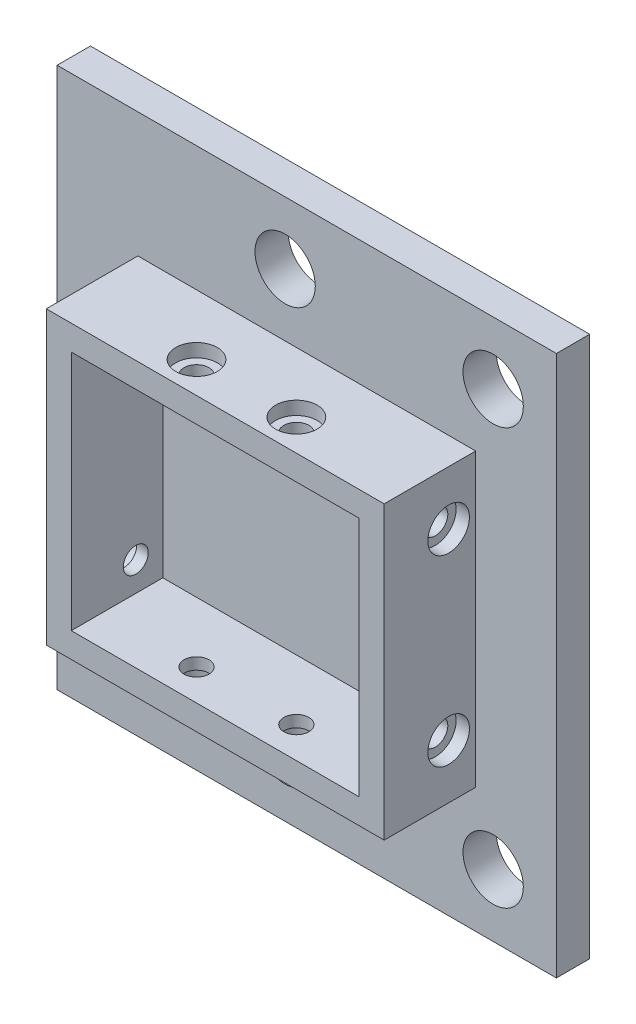
ISO-10303-21;
HEADER;
FILE_DESCRIPTION(('STEP AP214'),'2;1');
FILE_NAME('part.step','',(''),(''),'','','');
FILE_SCHEMA(('AUTOMOTIVE_DESIGN { 1 0 10303 214 1 1 1 1 }'));
ENDSEC;
DATA;
#1=APPLICATION_CONTEXT('core data for automotive mechanical design processes');
#2=APPLICATION_PROTOCOL_DEFINITION('international standard','automotive_design',2000,#1);
#3=PRODUCT_CONTEXT('',#1,'mechanical');
#4=PRODUCT('Part','Part','',(#3));
#5=PRODUCT_RELATED_PRODUCT_CATEGORY('part','',(#4));
#6=PRODUCT_DEFINITION_FORMATION('','',#4);
#7=PRODUCT_DEFINITION_CONTEXT('part definition',#1,'design');
#8=PRODUCT_DEFINITION('design','',#6,#7);
#9=PRODUCT_DEFINITION_SHAPE('','',#8);
#10=(LENGTH_UNIT() NAMED_UNIT(*) SI_UNIT(.MILLI.,.METRE.));
#11=(NAMED_UNIT(*) PLANE_ANGLE_UNIT() SI_UNIT($,.RADIAN.));
#12=(NAMED_UNIT(*) SI_UNIT($,.STERADIAN.) SOLID_ANGLE_UNIT());
#13=UNCERTAINTY_MEASURE_WITH_UNIT(LENGTH_MEASURE(1.E-05),#10,'distance_accuracy_value','');
#14=(GEOMETRIC_REPRESENTATION_CONTEXT(3) GLOBAL_UNCERTAINTY_ASSIGNED_CONTEXT((#13)) GLOBAL_UNIT_ASSIGNED_CONTEXT((#10,
#11,#12)) REPRESENTATION_CONTEXT('',''));
#15=CARTESIAN_POINT('',(0.,0.,0.));
#16=DIRECTION('',(0.,0.,1.));
#17=DIRECTION('',(1.,0.,0.));
#18=AXIS2_PLACEMENT_3D('',#15,#16,#17);
#19=CARTESIAN_POINT('',(30.,11.,7.25));
#20=DIRECTION('',(-1.,0.,0.));
#21=DIRECTION('',(0.,0.,1.));
#22=AXIS2_PLACEMENT_3D('',#19,#20,#21);
#23=CYLINDRICAL_SURFACE('',#22,1.5);
#24=CARTESIAN_POINT('',(17.3,11.,7.25));
#25=DIRECTION('',(-1.,0.,0.));
#26=DIRECTION('',(0.,0.,1.));
#27=AXIS2_PLACEMENT_3D('',#24,#25,#26);
#28=CIRCLE('',#27,1.5);
#29=CARTESIAN_POINT('',(17.3,11.,8.75));
#30=VERTEX_POINT('',#29);
#31=EDGE_CURVE('E274',#30,#30,#28,.T.);
#32=ORIENTED_EDGE('',*,*,#31,.T.);
#33=EDGE_LOOP('',(#32));
#34=FACE_BOUND('',#33,.T.);
#35=CARTESIAN_POINT('',(18.7,11.,7.25));
#36=DIRECTION('',(1.,0.,0.));
#37=DIRECTION('',(0.,0.,-1.));
#38=AXIS2_PLACEMENT_3D('',#35,#36,#37);
#39=CIRCLE('',#38,1.5);
#40=CARTESIAN_POINT('',(18.7,11.,5.75));
#41=VERTEX_POINT('',#40);
#42=EDGE_CURVE('E285',#41,#41,#39,.F.);
#43=ORIENTED_EDGE('',*,*,#42,.F.);
#44=EDGE_LOOP('',(#43));
#45=FACE_BOUND('',#44,.T.);
#46=ADVANCED_FACE('F33',(#34,#45),#23,.F.);
#47=CARTESIAN_POINT('',(-17.3,11.,7.25));
#48=DIRECTION('',(1.,0.,0.));
#49=DIRECTION('',(0.,0.,-1.));
#50=AXIS2_PLACEMENT_3D('',#47,#48,#49);
#51=CIRCLE('',#50,1.5);
#52=CARTESIAN_POINT('',(-17.3,11.,5.75));
#53=VERTEX_POINT('',#52);
#54=EDGE_CURVE('E273',#53,#53,#51,.T.);
#55=ORIENTED_EDGE('',*,*,#54,.T.);
#56=EDGE_LOOP('',(#55));
#57=FACE_BOUND('',#56,.T.);
#58=CARTESIAN_POINT('',(-18.7,11.,7.25));
#59=DIRECTION('',(-1.,0.,0.));
#60=DIRECTION('',(0.,0.,1.));
#61=AXIS2_PLACEMENT_3D('',#58,#59,#60);
#62=CIRCLE('',#61,1.5);
#63=CARTESIAN_POINT('',(-18.7,11.,8.75));
#64=VERTEX_POINT('',#63);
#65=EDGE_CURVE('E277',#64,#64,#62,.F.);
#66=ORIENTED_EDGE('',*,*,#65,.F.);
#67=EDGE_LOOP('',(#66));
#68=FACE_BOUND('',#67,.T.);
#69=ADVANCED_FACE('F354',(#57,#68),#23,.F.);
#70=CARTESIAN_POINT('',(-6.00000000000001,32.5,11.25));
#71=DIRECTION('',(0.,-1.,0.));
#72=DIRECTION('',(1.,0.,0.));
#73=AXIS2_PLACEMENT_3D('',#70,#71,#72);
#74=CYLINDRICAL_SURFACE('',#73,1.5);
#75=CARTESIAN_POINT('',(-6.,14.5,11.25));
#76=DIRECTION('',(0.,-1.,0.));
#77=DIRECTION('',(1.,0.,0.));
#78=AXIS2_PLACEMENT_3D('',#75,#76,#77);
#79=CIRCLE('',#78,1.5);
#80=CARTESIAN_POINT('',(-4.5,14.5,11.25));
#81=VERTEX_POINT('',#80);
#82=EDGE_CURVE('E243',#81,#81,#79,.T.);
#83=ORIENTED_EDGE('',*,*,#82,.T.);
#84=EDGE_LOOP('',(#83));
#85=FACE_BOUND('',#84,.T.);
#86=CARTESIAN_POINT('',(-6.,15.9,11.25));
#87=DIRECTION('',(0.,1.,0.));
#88=DIRECTION('',(-1.,0.,0.));
#89=AXIS2_PLACEMENT_3D('',#86,#87,#88);
#90=CIRCLE('',#89,1.5);
#91=CARTESIAN_POINT('',(-7.5,15.9,11.25));
#92=VERTEX_POINT('',#91);
#93=EDGE_CURVE('E259',#92,#92,#90,.F.);
#94=ORIENTED_EDGE('',*,*,#93,.F.);
#95=EDGE_LOOP('',(#94));
#96=FACE_BOUND('',#95,.T.);
#97=ADVANCED_FACE('F360',(#85,#96),#74,.F.);
#98=CARTESIAN_POINT('',(-6.,-14.5,11.25));
#99=DIRECTION('',(0.,1.,0.));
#100=DIRECTION('',(-1.,0.,0.));
#101=AXIS2_PLACEMENT_3D('',#98,#99,#100);
#102=CIRCLE('',#101,1.5);
#103=CARTESIAN_POINT('',(-7.5,-14.5,11.25));
#104=VERTEX_POINT('',#103);
#105=EDGE_CURVE('E157',#104,#104,#102,.T.);
#106=ORIENTED_EDGE('',*,*,#105,.T.);
#107=EDGE_LOOP('',(#106));
#108=FACE_BOUND('',#107,.T.);
#109=CARTESIAN_POINT('',(-6.,-15.9,11.25));
#110=DIRECTION('',(0.,-1.,0.));
#111=DIRECTION('',(1.,0.,0.));
#112=AXIS2_PLACEMENT_3D('',#109,#110,#111);
#113=CIRCLE('',#112,1.5);
#114=CARTESIAN_POINT('',(-4.5,-15.9,11.25));
#115=VERTEX_POINT('',#114);
#116=EDGE_CURVE('E250',#115,#115,#113,.F.);
#117=ORIENTED_EDGE('',*,*,#116,.F.);
#118=EDGE_LOOP('',(#117));
#119=FACE_BOUND('',#118,.T.);
#120=ADVANCED_FACE('F335',(#108,#119),#74,.F.);
#121=CARTESIAN_POINT('',(0.,0.,4.));
#122=DIRECTION('',(0.,0.,1.));
#123=DIRECTION('',(1.,0.,0.));
#124=AXIS2_PLACEMENT_3D('',#121,#122,#123);
#125=PLANE('',#124);
#126=CARTESIAN_POINT('',(22.4,-25.,4.));
#127=DIRECTION('',(0.,0.,1.));
#128=DIRECTION('',(1.,0.,0.));
#129=AXIS2_PLACEMENT_3D('',#126,#127,#128);
#130=CIRCLE('',#129,3.625);
#131=CARTESIAN_POINT('',(26.025,-25.,4.));
#132=VERTEX_POINT('',#131);
#133=EDGE_CURVE('E194',#132,#132,#130,.T.);
#134=ORIENTED_EDGE('',*,*,#133,.F.);
#135=EDGE_LOOP('',(#134));
#136=FACE_BOUND('',#135,.T.);
#137=CARTESIAN_POINT('',(-2.6,-25.,4.));
#138=DIRECTION('',(0.,0.,1.));
#139=DIRECTION('',(1.,0.,0.));
#140=AXIS2_PLACEMENT_3D('',#137,#138,#139);
#141=CIRCLE('',#140,3.625);
#142=CARTESIAN_POINT('',(1.025,-25.,4.));
#143=VERTEX_POINT('',#142);
#144=EDGE_CURVE('E206',#143,#143,#141,.T.);
#145=ORIENTED_EDGE('',*,*,#144,.F.);
#146=EDGE_LOOP('',(#145));
#147=FACE_BOUND('',#146,.T.);
#148=DIRECTION('',(0.,-1.,0.));
#149=VECTOR('',#148,1.);
#150=CARTESIAN_POINT('',(-30.,-32.5,4.));
#151=LINE('',#150,#149);
#152=CARTESIAN_POINT('',(-30.,32.5,4.));
#153=VERTEX_POINT('',#152);
#154=CARTESIAN_POINT('',(-30.,-32.5,4.));
#155=VERTEX_POINT('',#154);
#156=EDGE_CURVE('E218',#153,#155,#151,.T.);
#157=ORIENTED_EDGE('',*,*,#156,.T.);
#158=DIRECTION('',(1.,0.,0.));
#159=VECTOR('',#158,1.);
#160=CARTESIAN_POINT('',(30.,-32.5,4.));
#161=LINE('',#160,#159);
#162=CARTESIAN_POINT('',(30.,-32.5,4.));
#163=VERTEX_POINT('',#162);
#164=EDGE_CURVE('E221',#155,#163,#161,.T.);
#165=ORIENTED_EDGE('',*,*,#164,.T.);
#166=DIRECTION('',(0.,1.,0.));
#167=VECTOR('',#166,1.);
#168=CARTESIAN_POINT('',(30.,-32.5,4.));
#169=LINE('',#168,#167);
#170=CARTESIAN_POINT('',(30.,32.5,4.));
#171=VERTEX_POINT('',#170);
#172=EDGE_CURVE('E224',#163,#171,#169,.T.);
#173=ORIENTED_EDGE('',*,*,#172,.T.);
#174=DIRECTION('',(-1.,0.,0.));
#175=VECTOR('',#174,1.);
#176=CARTESIAN_POINT('',(30.,32.5,4.));
#177=LINE('',#176,#175);
#178=EDGE_CURVE('E226',#171,#153,#177,.T.);
#179=ORIENTED_EDGE('',*,*,#178,.T.);
#180=EDGE_LOOP('',(#157,#165,#173,#179));
#181=FACE_BOUND('',#180,.T.);
#182=CARTESIAN_POINT('',(-2.6,25.,4.));
#183=DIRECTION('',(0.,0.,1.));
#184=DIRECTION('',(1.,0.,0.));
#185=AXIS2_PLACEMENT_3D('',#182,#183,#184);
#186=CIRCLE('',#185,3.625);
#187=CARTESIAN_POINT('',(1.025,25.,4.));
#188=VERTEX_POINT('',#187);
#189=EDGE_CURVE('E212',#188,#188,#186,.T.);
#190=ORIENTED_EDGE('',*,*,#189,.F.);
#191=EDGE_LOOP('',(#190));
#192=FACE_BOUND('',#191,.T.);
#193=CARTESIAN_POINT('',(22.4,25.,4.));
#194=DIRECTION('',(0.,0.,1.));
#195=DIRECTION('',(1.,0.,0.));
#196=AXIS2_PLACEMENT_3D('',#193,#194,#195);
#197=CIRCLE('',#196,3.625);
#198=CARTESIAN_POINT('',(26.025,25.,4.));
#199=VERTEX_POINT('',#198);
#200=EDGE_CURVE('E200',#199,#199,#197,.T.);
#201=ORIENTED_EDGE('',*,*,#200,.F.);
#202=EDGE_LOOP('',(#201));
#203=FACE_BOUND('',#202,.T.);
#204=DIRECTION('',(1.,0.,0.));
#205=VECTOR('',#204,1.);
#206=CARTESIAN_POINT('',(20.3,-17.5,4.));
#207=LINE('',#206,#205);
#208=CARTESIAN_POINT('',(-20.3,-17.5,4.));
#209=VERTEX_POINT('',#208);
#210=CARTESIAN_POINT('',(20.3,-17.5,4.));
#211=VERTEX_POINT('',#210);
#212=EDGE_CURVE('E180',#209,#211,#207,.T.);
#213=ORIENTED_EDGE('',*,*,#212,.F.);
#214=DIRECTION('',(0.,-1.,0.));
#215=VECTOR('',#214,1.);
#216=CARTESIAN_POINT('',(-20.3,-17.5,4.));
#217=LINE('',#216,#215);
#218=CARTESIAN_POINT('',(-20.3,17.5,4.));
#219=VERTEX_POINT('',#218);
#220=EDGE_CURVE('E143',#219,#209,#217,.T.);
#221=ORIENTED_EDGE('',*,*,#220,.F.);
#222=DIRECTION('',(-1.,0.,0.));
#223=VECTOR('',#222,1.);
#224=CARTESIAN_POINT('',(20.3,17.5,4.));
#225=LINE('',#224,#223);
#226=CARTESIAN_POINT('',(20.3,17.5,4.));
#227=VERTEX_POINT('',#226);
#228=EDGE_CURVE('E171',#227,#219,#225,.T.);
#229=ORIENTED_EDGE('',*,*,#228,.F.);
#230=DIRECTION('',(0.,1.,0.));
#231=VECTOR('',#230,1.);
#232=CARTESIAN_POINT('',(20.3,-17.5,4.));
#233=LINE('',#232,#231);
#234=EDGE_CURVE('E182',#211,#227,#233,.T.);
#235=ORIENTED_EDGE('',*,*,#234,.F.);
#236=EDGE_LOOP('',(#213,#221,#229,#235));
#237=FACE_BOUND('',#236,.T.);
#238=ADVANCED_FACE('F419',(#136,#147,#181,#192,#203,#237),#125,.T.);
#239=CARTESIAN_POINT('',(0.,0.,0.));
#240=DIRECTION('',(0.,0.,1.));
#241=DIRECTION('',(1.,0.,0.));
#242=AXIS2_PLACEMENT_3D('',#239,#240,#241);
#243=PLANE('',#242);
#244=DIRECTION('',(0.,-1.,0.));
#245=VECTOR('',#244,1.);
#246=CARTESIAN_POINT('',(-30.,-32.5,0.));
#247=LINE('',#246,#245);
#248=CARTESIAN_POINT('',(-30.,32.5,0.));
#249=VERTEX_POINT('',#248);
#250=CARTESIAN_POINT('',(-30.,-32.5,0.));
#251=VERTEX_POINT('',#250);
#252=EDGE_CURVE('E215',#249,#251,#247,.T.);
#253=ORIENTED_EDGE('',*,*,#252,.F.);
#254=DIRECTION('',(-1.,0.,0.));
#255=VECTOR('',#254,1.);
#256=CARTESIAN_POINT('',(30.,32.5,0.));
#257=LINE('',#256,#255);
#258=CARTESIAN_POINT('',(30.,32.5,0.));
#259=VERTEX_POINT('',#258);
#260=EDGE_CURVE('E222',#259,#249,#257,.T.);
#261=ORIENTED_EDGE('',*,*,#260,.F.);
#262=DIRECTION('',(0.,1.,0.));
#263=VECTOR('',#262,1.);
#264=CARTESIAN_POINT('',(30.,-32.5,0.));
#265=LINE('',#264,#263);
#266=CARTESIAN_POINT('',(30.,-32.5,0.));
#267=VERTEX_POINT('',#266);
#268=EDGE_CURVE('E233',#267,#259,#265,.T.);
#269=ORIENTED_EDGE('',*,*,#268,.F.);
#270=DIRECTION('',(1.,0.,0.));
#271=VECTOR('',#270,1.);
#272=CARTESIAN_POINT('',(30.,-32.5,0.));
#273=LINE('',#272,#271);
#274=EDGE_CURVE('E231',#251,#267,#273,.T.);
#275=ORIENTED_EDGE('',*,*,#274,.F.);
#276=EDGE_LOOP('',(#253,#261,#269,#275));
#277=FACE_BOUND('',#276,.T.);
#278=CARTESIAN_POINT('',(-2.6,25.,0.));
#279=DIRECTION('',(0.,0.,1.));
#280=DIRECTION('',(1.,0.,0.));
#281=AXIS2_PLACEMENT_3D('',#278,#279,#280);
#282=CIRCLE('',#281,3.625);
#283=CARTESIAN_POINT('',(1.025,25.,0.));
#284=VERTEX_POINT('',#283);
#285=EDGE_CURVE('E209',#284,#284,#282,.T.);
#286=ORIENTED_EDGE('',*,*,#285,.T.);
#287=EDGE_LOOP('',(#286));
#288=FACE_BOUND('',#287,.T.);
#289=CARTESIAN_POINT('',(-2.6,-25.,0.));
#290=DIRECTION('',(0.,0.,1.));
#291=DIRECTION('',(1.,0.,0.));
#292=AXIS2_PLACEMENT_3D('',#289,#290,#291);
#293=CIRCLE('',#292,3.625);
#294=CARTESIAN_POINT('',(1.025,-25.,0.));
#295=VERTEX_POINT('',#294);
#296=EDGE_CURVE('E203',#295,#295,#293,.T.);
#297=ORIENTED_EDGE('',*,*,#296,.T.);
#298=EDGE_LOOP('',(#297));
#299=FACE_BOUND('',#298,.T.);
#300=CARTESIAN_POINT('',(22.4,25.,0.));
#301=DIRECTION('',(0.,0.,1.));
#302=DIRECTION('',(1.,0.,0.));
#303=AXIS2_PLACEMENT_3D('',#300,#301,#302);
#304=CIRCLE('',#303,3.625);
#305=CARTESIAN_POINT('',(26.025,25.,0.));
#306=VERTEX_POINT('',#305);
#307=EDGE_CURVE('E197',#306,#306,#304,.T.);
#308=ORIENTED_EDGE('',*,*,#307,.T.);
#309=EDGE_LOOP('',(#308));
#310=FACE_BOUND('',#309,.T.);
#311=CARTESIAN_POINT('',(22.4,-25.,0.));
#312=DIRECTION('',(0.,0.,1.));
#313=DIRECTION('',(1.,0.,0.));
#314=AXIS2_PLACEMENT_3D('',#311,#312,#313);
#315=CIRCLE('',#314,3.625);
#316=CARTESIAN_POINT('',(26.025,-25.,0.));
#317=VERTEX_POINT('',#316);
#318=EDGE_CURVE('E193',#317,#317,#315,.T.);
#319=ORIENTED_EDGE('',*,*,#318,.T.);
#320=EDGE_LOOP('',(#319));
#321=FACE_BOUND('',#320,.T.);
#322=ADVANCED_FACE('F436',(#277,#288,#299,#310,#321),#243,.F.);
#323=CARTESIAN_POINT('',(-30.,-32.5,4.));
#324=DIRECTION('',(1.,0.,0.));
#325=DIRECTION('',(0.,0.,-1.));
#326=AXIS2_PLACEMENT_3D('',#323,#324,#325);
#327=PLANE('',#326);
#328=ORIENTED_EDGE('',*,*,#252,.T.);
#329=DIRECTION('',(0.,0.,-1.));
#330=VECTOR('',#329,1.);
#331=CARTESIAN_POINT('',(-30.,-32.5,4.));
#332=LINE('',#331,#330);
#333=EDGE_CURVE('E11',#155,#251,#332,.T.);
#334=ORIENTED_EDGE('',*,*,#333,.F.);
#335=ORIENTED_EDGE('',*,*,#156,.F.);
#336=DIRECTION('',(0.,0.,-1.));
#337=VECTOR('',#336,1.);
#338=CARTESIAN_POINT('',(-30.,32.5,4.));
#339=LINE('',#338,#337);
#340=EDGE_CURVE('E228',#153,#249,#339,.T.);
#341=ORIENTED_EDGE('',*,*,#340,.T.);
#342=EDGE_LOOP('',(#328,#334,#335,#341));
#343=FACE_BOUND('',#342,.T.);
#344=ADVANCED_FACE('F35',(#343),#327,.F.);
#345=CARTESIAN_POINT('',(30.,-32.5,4.));
#346=DIRECTION('',(0.,1.,0.));
#347=DIRECTION('',(0.,0.,1.));
#348=AXIS2_PLACEMENT_3D('',#345,#346,#347);
#349=PLANE('',#348);
#350=ORIENTED_EDGE('',*,*,#274,.T.);
#351=DIRECTION('',(0.,0.,-1.));
#352=VECTOR('',#351,1.);
#353=CARTESIAN_POINT('',(30.,-32.5,4.));
#354=LINE('',#353,#352);
#355=EDGE_CURVE('E42',#163,#267,#354,.T.);
#356=ORIENTED_EDGE('',*,*,#355,.F.);
#357=ORIENTED_EDGE('',*,*,#164,.F.);
#358=ORIENTED_EDGE('',*,*,#333,.T.);
#359=EDGE_LOOP('',(#350,#356,#357,#358));
#360=FACE_BOUND('',#359,.T.);
#361=ADVANCED_FACE('F523',(#360),#349,.F.);
#362=CARTESIAN_POINT('',(30.,-32.5,4.));
#363=DIRECTION('',(-1.,0.,0.));
#364=DIRECTION('',(0.,0.,1.));
#365=AXIS2_PLACEMENT_3D('',#362,#363,#364);
#366=PLANE('',#365);
#367=ORIENTED_EDGE('',*,*,#268,.T.);
#368=DIRECTION('',(0.,0.,-1.));
#369=VECTOR('',#368,1.);
#370=CARTESIAN_POINT('',(30.,32.5,4.));
#371=LINE('',#370,#369);
#372=EDGE_CURVE('E238',#171,#259,#371,.T.);
#373=ORIENTED_EDGE('',*,*,#372,.F.);
#374=ORIENTED_EDGE('',*,*,#172,.F.);
#375=ORIENTED_EDGE('',*,*,#355,.T.);
#376=EDGE_LOOP('',(#367,#373,#374,#375));
#377=FACE_BOUND('',#376,.T.);
#378=ADVANCED_FACE('F505',(#377),#366,.F.);
#379=CARTESIAN_POINT('',(30.,32.5,4.));
#380=DIRECTION('',(0.,-1.,0.));
#381=DIRECTION('',(0.,0.,-1.));
#382=AXIS2_PLACEMENT_3D('',#379,#380,#381);
#383=PLANE('',#382);
#384=ORIENTED_EDGE('',*,*,#260,.T.);
#385=ORIENTED_EDGE('',*,*,#340,.F.);
#386=ORIENTED_EDGE('',*,*,#178,.F.);
#387=ORIENTED_EDGE('',*,*,#372,.T.);
#388=EDGE_LOOP('',(#384,#385,#386,#387));
#389=FACE_BOUND('',#388,.T.);
#390=ADVANCED_FACE('F500',(#389),#383,.F.);
#391=CARTESIAN_POINT('',(-2.6,25.,4.));
#392=DIRECTION('',(0.,0.,-1.));
#393=DIRECTION('',(-1.,0.,0.));
#394=AXIS2_PLACEMENT_3D('',#391,#392,#393);
#395=CYLINDRICAL_SURFACE('',#394,3.625);
#396=ORIENTED_EDGE('',*,*,#189,.T.);
#397=EDGE_LOOP('',(#396));
#398=FACE_BOUND('',#397,.T.);
#399=ORIENTED_EDGE('',*,*,#285,.F.);
#400=EDGE_LOOP('',(#399));
#401=FACE_BOUND('',#400,.T.);
#402=ADVANCED_FACE('F497',(#398,#401),#395,.F.);
#403=CARTESIAN_POINT('',(-2.6,-25.,4.));
#404=DIRECTION('',(0.,0.,-1.));
#405=DIRECTION('',(-1.,0.,0.));
#406=AXIS2_PLACEMENT_3D('',#403,#404,#405);
#407=CYLINDRICAL_SURFACE('',#406,3.625);
#408=ORIENTED_EDGE('',*,*,#144,.T.);
#409=EDGE_LOOP('',(#408));
#410=FACE_BOUND('',#409,.T.);
#411=ORIENTED_EDGE('',*,*,#296,.F.);
#412=EDGE_LOOP('',(#411));
#413=FACE_BOUND('',#412,.T.);
#414=ADVANCED_FACE('F494',(#410,#413),#407,.F.);
#415=CARTESIAN_POINT('',(22.4,25.,4.));
#416=DIRECTION('',(0.,0.,-1.));
#417=DIRECTION('',(-1.,0.,0.));
#418=AXIS2_PLACEMENT_3D('',#415,#416,#417);
#419=CYLINDRICAL_SURFACE('',#418,3.625);
#420=ORIENTED_EDGE('',*,*,#200,.T.);
#421=EDGE_LOOP('',(#420));
#422=FACE_BOUND('',#421,.T.);
#423=ORIENTED_EDGE('',*,*,#307,.F.);
#424=EDGE_LOOP('',(#423));
#425=FACE_BOUND('',#424,.T.);
#426=ADVANCED_FACE('F490',(#422,#425),#419,.F.);
#427=CARTESIAN_POINT('',(22.4,-25.,4.));
#428=DIRECTION('',(0.,0.,-1.));
#429=DIRECTION('',(-1.,0.,0.));
#430=AXIS2_PLACEMENT_3D('',#427,#428,#429);
#431=CYLINDRICAL_SURFACE('',#430,3.625);
#432=ORIENTED_EDGE('',*,*,#133,.T.);
#433=EDGE_LOOP('',(#432));
#434=FACE_BOUND('',#433,.T.);
#435=ORIENTED_EDGE('',*,*,#318,.F.);
#436=EDGE_LOOP('',(#435));
#437=FACE_BOUND('',#436,.T.);
#438=ADVANCED_FACE('F487',(#434,#437),#431,.F.);
#439=CARTESIAN_POINT('',(0.,0.,15.));
#440=DIRECTION('',(0.,0.,1.));
#441=DIRECTION('',(1.,0.,0.));
#442=AXIS2_PLACEMENT_3D('',#439,#440,#441);
#443=PLANE('',#442);
#444=DIRECTION('',(0.,-1.,0.));
#445=VECTOR('',#444,1.);
#446=CARTESIAN_POINT('',(-20.3,-17.5,15.));
#447=LINE('',#446,#445);
#448=CARTESIAN_POINT('',(-20.3,17.5,15.));
#449=VERTEX_POINT('',#448);
#450=CARTESIAN_POINT('',(-20.3,-17.5,15.));
#451=VERTEX_POINT('',#450);
#452=EDGE_CURVE('E167',#449,#451,#447,.T.);
#453=ORIENTED_EDGE('',*,*,#452,.T.);
#454=DIRECTION('',(1.,0.,0.));
#455=VECTOR('',#454,1.);
#456=CARTESIAN_POINT('',(20.3,-17.5,15.));
#457=LINE('',#456,#455);
#458=CARTESIAN_POINT('',(20.3,-17.5,15.));
#459=VERTEX_POINT('',#458);
#460=EDGE_CURVE('E170',#451,#459,#457,.T.);
#461=ORIENTED_EDGE('',*,*,#460,.T.);
#462=DIRECTION('',(0.,1.,0.));
#463=VECTOR('',#462,1.);
#464=CARTESIAN_POINT('',(20.3,-17.5,15.));
#465=LINE('',#464,#463);
#466=CARTESIAN_POINT('',(20.3,17.5,15.));
#467=VERTEX_POINT('',#466);
#468=EDGE_CURVE('E173',#459,#467,#465,.T.);
#469=ORIENTED_EDGE('',*,*,#468,.T.);
#470=DIRECTION('',(-1.,0.,0.));
#471=VECTOR('',#470,1.);
#472=CARTESIAN_POINT('',(20.3,17.5,15.));
#473=LINE('',#472,#471);
#474=EDGE_CURVE('E175',#467,#449,#473,.T.);
#475=ORIENTED_EDGE('',*,*,#474,.T.);
#476=EDGE_LOOP('',(#453,#461,#469,#475));
#477=FACE_BOUND('',#476,.T.);
#478=DIRECTION('',(1.,0.,0.));
#479=VECTOR('',#478,1.);
#480=CARTESIAN_POINT('',(17.3,-14.5,15.));
#481=LINE('',#480,#479);
#482=CARTESIAN_POINT('',(-17.3,-14.5,15.));
#483=VERTEX_POINT('',#482);
#484=CARTESIAN_POINT('',(17.3,-14.5,15.));
#485=VERTEX_POINT('',#484);
#486=EDGE_CURVE('E135',#483,#485,#481,.T.);
#487=ORIENTED_EDGE('',*,*,#486,.F.);
#488=DIRECTION('',(0.,-1.,0.));
#489=VECTOR('',#488,1.);
#490=CARTESIAN_POINT('',(-17.3,-14.5,15.));
#491=LINE('',#490,#489);
#492=CARTESIAN_POINT('',(-17.3,14.5,15.));
#493=VERTEX_POINT('',#492);
#494=EDGE_CURVE('E126',#493,#483,#491,.T.);
#495=ORIENTED_EDGE('',*,*,#494,.F.);
#496=DIRECTION('',(-1.,0.,0.));
#497=VECTOR('',#496,1.);
#498=CARTESIAN_POINT('',(17.3,14.5,15.));
#499=LINE('',#498,#497);
#500=CARTESIAN_POINT('',(17.3,14.5,15.));
#501=VERTEX_POINT('',#500);
#502=EDGE_CURVE('E151',#501,#493,#499,.T.);
#503=ORIENTED_EDGE('',*,*,#502,.F.);
#504=DIRECTION('',(0.,1.,0.));
#505=VECTOR('',#504,1.);
#506=CARTESIAN_POINT('',(17.3,-14.5,15.));
#507=LINE('',#506,#505);
#508=EDGE_CURVE('E149',#485,#501,#507,.T.);
#509=ORIENTED_EDGE('',*,*,#508,.F.);
#510=EDGE_LOOP('',(#487,#495,#503,#509));
#511=FACE_BOUND('',#510,.T.);
#512=ADVANCED_FACE('F147',(#477,#511),#443,.T.);
#513=CARTESIAN_POINT('',(-20.3,-17.5,15.));
#514=DIRECTION('',(1.,0.,0.));
#515=DIRECTION('',(0.,0.,-1.));
#516=AXIS2_PLACEMENT_3D('',#513,#514,#515);
#517=PLANE('',#516);
#518=CARTESIAN_POINT('',(-20.3,-11.,7.25));
#519=DIRECTION('',(-1.,0.,0.));
#520=DIRECTION('',(0.,0.,-1.));
#521=AXIS2_PLACEMENT_3D('',#518,#519,#520);
#522=CIRCLE('',#521,2.5);
#523=CARTESIAN_POINT('',(-20.3,-11.,4.75));
#524=VERTEX_POINT('',#523);
#525=EDGE_CURVE('E287',#524,#524,#522,.T.);
#526=ORIENTED_EDGE('',*,*,#525,.F.);
#527=EDGE_LOOP('',(#526));
#528=FACE_BOUND('',#527,.T.);
#529=CARTESIAN_POINT('',(-20.3,11.,7.25));
#530=DIRECTION('',(-1.,0.,0.));
#531=DIRECTION('',(0.,0.,1.));
#532=AXIS2_PLACEMENT_3D('',#529,#530,#531);
#533=CIRCLE('',#532,2.5);
#534=CARTESIAN_POINT('',(-20.3,11.,9.75));
#535=VERTEX_POINT('',#534);
#536=EDGE_CURVE('E283',#535,#535,#533,.T.);
#537=ORIENTED_EDGE('',*,*,#536,.F.);
#538=EDGE_LOOP('',(#537));
#539=FACE_BOUND('',#538,.T.);
#540=ORIENTED_EDGE('',*,*,#220,.T.);
#541=DIRECTION('',(0.,0.,-1.));
#542=VECTOR('',#541,1.);
#543=CARTESIAN_POINT('',(-20.3,-17.5,15.));
#544=LINE('',#543,#542);
#545=EDGE_CURVE('E191',#451,#209,#544,.T.);
#546=ORIENTED_EDGE('',*,*,#545,.F.);
#547=ORIENTED_EDGE('',*,*,#452,.F.);
#548=DIRECTION('',(0.,0.,-1.));
#549=VECTOR('',#548,1.);
#550=CARTESIAN_POINT('',(-20.3,17.5,15.));
#551=LINE('',#550,#549);
#552=EDGE_CURVE('E177',#449,#219,#551,.T.);
#553=ORIENTED_EDGE('',*,*,#552,.T.);
#554=EDGE_LOOP('',(#540,#546,#547,#553));
#555=FACE_BOUND('',#554,.T.);
#556=ADVANCED_FACE('F469',(#528,#539,#555),#517,.F.);
#557=CARTESIAN_POINT('',(20.3,-17.5,15.));
#558=DIRECTION('',(0.,1.,0.));
#559=DIRECTION('',(-1.,0.,0.));
#560=AXIS2_PLACEMENT_3D('',#557,#558,#559);
#561=PLANE('',#560);
#562=CARTESIAN_POINT('',(6.,-17.5,11.25));
#563=DIRECTION('',(0.,-1.,0.));
#564=DIRECTION('',(-1.,0.,0.));
#565=AXIS2_PLACEMENT_3D('',#562,#563,#564);
#566=CIRCLE('',#565,2.5);
#567=CARTESIAN_POINT('',(3.5,-17.5,11.25));
#568=VERTEX_POINT('',#567);
#569=EDGE_CURVE('E262',#568,#568,#566,.T.);
#570=ORIENTED_EDGE('',*,*,#569,.F.);
#571=EDGE_LOOP('',(#570));
#572=FACE_BOUND('',#571,.T.);
#573=CARTESIAN_POINT('',(-6.,-17.5,11.25));
#574=DIRECTION('',(0.,-1.,0.));
#575=DIRECTION('',(1.,0.,0.));
#576=AXIS2_PLACEMENT_3D('',#573,#574,#575);
#577=CIRCLE('',#576,2.5);
#578=CARTESIAN_POINT('',(-3.5,-17.5,11.25));
#579=VERTEX_POINT('',#578);
#580=EDGE_CURVE('E257',#579,#579,#577,.T.);
#581=ORIENTED_EDGE('',*,*,#580,.F.);
#582=EDGE_LOOP('',(#581));
#583=FACE_BOUND('',#582,.T.);
#584=ORIENTED_EDGE('',*,*,#212,.T.);
#585=DIRECTION('',(0.,0.,-1.));
#586=VECTOR('',#585,1.);
#587=CARTESIAN_POINT('',(20.3,-17.5,15.));
#588=LINE('',#587,#586);
#589=EDGE_CURVE('E188',#459,#211,#588,.T.);
#590=ORIENTED_EDGE('',*,*,#589,.F.);
#591=ORIENTED_EDGE('',*,*,#460,.F.);
#592=ORIENTED_EDGE('',*,*,#545,.T.);
#593=EDGE_LOOP('',(#584,#590,#591,#592));
#594=FACE_BOUND('',#593,.T.);
#595=ADVANCED_FACE('F460',(#572,#583,#594),#561,.F.);
#596=CARTESIAN_POINT('',(20.3,-17.5,15.));
#597=DIRECTION('',(-1.,0.,0.));
#598=DIRECTION('',(0.,0.,1.));
#599=AXIS2_PLACEMENT_3D('',#596,#597,#598);
#600=PLANE('',#599);
#601=CARTESIAN_POINT('',(20.3,-11.,7.25));
#602=DIRECTION('',(-1.,0.,0.));
#603=DIRECTION('',(0.,0.,-1.));
#604=AXIS2_PLACEMENT_3D('',#601,#602,#603);
#605=CIRCLE('',#604,2.5);
#606=CARTESIAN_POINT('',(20.3,-11.,4.75));
#607=VERTEX_POINT('',#606);
#608=EDGE_CURVE('E301',#607,#607,#605,.T.);
#609=ORIENTED_EDGE('',*,*,#608,.T.);
#610=EDGE_LOOP('',(#609));
#611=FACE_BOUND('',#610,.T.);
#612=CARTESIAN_POINT('',(20.3,11.,7.25));
#613=DIRECTION('',(-1.,0.,0.));
#614=DIRECTION('',(0.,0.,1.));
#615=AXIS2_PLACEMENT_3D('',#612,#613,#614);
#616=CIRCLE('',#615,2.5);
#617=CARTESIAN_POINT('',(20.3,11.,9.75));
#618=VERTEX_POINT('',#617);
#619=EDGE_CURVE('E294',#618,#618,#616,.T.);
#620=ORIENTED_EDGE('',*,*,#619,.T.);
#621=EDGE_LOOP('',(#620));
#622=FACE_BOUND('',#621,.T.);
#623=ORIENTED_EDGE('',*,*,#234,.T.);
#624=DIRECTION('',(0.,0.,-1.));
#625=VECTOR('',#624,1.);
#626=CARTESIAN_POINT('',(20.3,17.5,15.));
#627=LINE('',#626,#625);
#628=EDGE_CURVE('E50',#467,#227,#627,.T.);
#629=ORIENTED_EDGE('',*,*,#628,.F.);
#630=ORIENTED_EDGE('',*,*,#468,.F.);
#631=ORIENTED_EDGE('',*,*,#589,.T.);
#632=EDGE_LOOP('',(#623,#629,#630,#631));
#633=FACE_BOUND('',#632,.T.);
#634=ADVANCED_FACE('F464',(#611,#622,#633),#600,.F.);
#635=CARTESIAN_POINT('',(20.3,17.5,15.));
#636=DIRECTION('',(0.,-1.,0.));
#637=DIRECTION('',(1.,0.,0.));
#638=AXIS2_PLACEMENT_3D('',#635,#636,#637);
#639=PLANE('',#638);
#640=CARTESIAN_POINT('',(6.,17.5,11.25));
#641=DIRECTION('',(0.,-1.,0.));
#642=DIRECTION('',(-1.,0.,0.));
#643=AXIS2_PLACEMENT_3D('',#640,#641,#642);
#644=CIRCLE('',#643,2.5);
#645=CARTESIAN_POINT('',(3.5,17.5,11.25));
#646=VERTEX_POINT('',#645);
#647=EDGE_CURVE('E314',#646,#646,#644,.T.);
#648=ORIENTED_EDGE('',*,*,#647,.T.);
#649=EDGE_LOOP('',(#648));
#650=FACE_BOUND('',#649,.T.);
#651=CARTESIAN_POINT('',(-6.,17.5,11.25));
#652=DIRECTION('',(0.,-1.,0.));
#653=DIRECTION('',(1.,0.,0.));
#654=AXIS2_PLACEMENT_3D('',#651,#652,#653);
#655=CIRCLE('',#654,2.5);
#656=CARTESIAN_POINT('',(-3.5,17.5,11.25));
#657=VERTEX_POINT('',#656);
#658=EDGE_CURVE('E267',#657,#657,#655,.T.);
#659=ORIENTED_EDGE('',*,*,#658,.T.);
#660=EDGE_LOOP('',(#659));
#661=FACE_BOUND('',#660,.T.);
#662=ORIENTED_EDGE('',*,*,#228,.T.);
#663=ORIENTED_EDGE('',*,*,#552,.F.);
#664=ORIENTED_EDGE('',*,*,#474,.F.);
#665=ORIENTED_EDGE('',*,*,#628,.T.);
#666=EDGE_LOOP('',(#662,#663,#664,#665));
#667=FACE_BOUND('',#666,.T.);
#668=ADVANCED_FACE('F349',(#650,#661,#667),#639,.F.);
#669=CARTESIAN_POINT('',(-17.3,-14.5,15.));
#670=DIRECTION('',(1.,0.,0.));
#671=DIRECTION('',(0.,0.,-1.));
#672=AXIS2_PLACEMENT_3D('',#669,#670,#671);
#673=PLANE('',#672);
#674=ORIENTED_EDGE('',*,*,#54,.F.);
#675=EDGE_LOOP('',(#674));
#676=FACE_BOUND('',#675,.T.);
#677=CARTESIAN_POINT('',(-17.3,-11.,7.25));
#678=DIRECTION('',(1.,0.,0.));
#679=DIRECTION('',(0.,0.,-1.));
#680=AXIS2_PLACEMENT_3D('',#677,#678,#679);
#681=CIRCLE('',#680,1.5);
#682=CARTESIAN_POINT('',(-17.3,-11.,5.75));
#683=VERTEX_POINT('',#682);
#684=EDGE_CURVE('E272',#683,#683,#681,.T.);
#685=ORIENTED_EDGE('',*,*,#684,.F.);
#686=EDGE_LOOP('',(#685));
#687=FACE_BOUND('',#686,.T.);
#688=DIRECTION('',(0.,-1.,0.));
#689=VECTOR('',#688,1.);
#690=CARTESIAN_POINT('',(-17.3,-14.5,4.));
#691=LINE('',#690,#689);
#692=CARTESIAN_POINT('',(-17.3,14.5,4.));
#693=VERTEX_POINT('',#692);
#694=CARTESIAN_POINT('',(-17.3,-14.5,4.));
#695=VERTEX_POINT('',#694);
#696=EDGE_CURVE('E58',#693,#695,#691,.T.);
#697=ORIENTED_EDGE('',*,*,#696,.F.);
#698=DIRECTION('',(0.,0.,-1.));
#699=VECTOR('',#698,1.);
#700=CARTESIAN_POINT('',(-17.3,14.5,15.));
#701=LINE('',#700,#699);
#702=EDGE_CURVE('E131',#493,#693,#701,.T.);
#703=ORIENTED_EDGE('',*,*,#702,.F.);
#704=ORIENTED_EDGE('',*,*,#494,.T.);
#705=DIRECTION('',(0.,0.,-1.));
#706=VECTOR('',#705,1.);
#707=CARTESIAN_POINT('',(-17.3,-14.5,15.));
#708=LINE('',#707,#706);
#709=EDGE_CURVE('E129',#483,#695,#708,.T.);
#710=ORIENTED_EDGE('',*,*,#709,.T.);
#711=EDGE_LOOP('',(#697,#703,#704,#710));
#712=FACE_BOUND('',#711,.T.);
#713=ADVANCED_FACE('F128',(#676,#687,#712),#673,.T.);
#714=CARTESIAN_POINT('',(17.3,-14.5,15.));
#715=DIRECTION('',(0.,1.,0.));
#716=DIRECTION('',(-1.,0.,0.));
#717=AXIS2_PLACEMENT_3D('',#714,#715,#716);
#718=PLANE('',#717);
#719=CARTESIAN_POINT('',(6.,-14.5,11.25));
#720=DIRECTION('',(0.,1.,0.));
#721=DIRECTION('',(-1.,0.,0.));
#722=AXIS2_PLACEMENT_3D('',#719,#720,#721);
#723=CIRCLE('',#722,1.5);
#724=CARTESIAN_POINT('',(4.5,-14.5,11.25));
#725=VERTEX_POINT('',#724);
#726=EDGE_CURVE('E246',#725,#725,#723,.T.);
#727=ORIENTED_EDGE('',*,*,#726,.F.);
#728=EDGE_LOOP('',(#727));
#729=FACE_BOUND('',#728,.T.);
#730=ORIENTED_EDGE('',*,*,#105,.F.);
#731=EDGE_LOOP('',(#730));
#732=FACE_BOUND('',#731,.T.);
#733=DIRECTION('',(1.,0.,0.));
#734=VECTOR('',#733,1.);
#735=CARTESIAN_POINT('',(17.3,-14.5,4.));
#736=LINE('',#735,#734);
#737=CARTESIAN_POINT('',(17.3,-14.5,4.));
#738=VERTEX_POINT('',#737);
#739=EDGE_CURVE('E142',#695,#738,#736,.T.);
#740=ORIENTED_EDGE('',*,*,#739,.F.);
#741=ORIENTED_EDGE('',*,*,#709,.F.);
#742=ORIENTED_EDGE('',*,*,#486,.T.);
#743=DIRECTION('',(0.,0.,-1.));
#744=VECTOR('',#743,1.);
#745=CARTESIAN_POINT('',(17.3,-14.5,15.));
#746=LINE('',#745,#744);
#747=EDGE_CURVE('E144',#485,#738,#746,.T.);
#748=ORIENTED_EDGE('',*,*,#747,.T.);
#749=EDGE_LOOP('',(#740,#741,#742,#748));
#750=FACE_BOUND('',#749,.T.);
#751=ADVANCED_FACE('F139',(#729,#732,#750),#718,.T.);
#752=CARTESIAN_POINT('',(17.3,-14.5,15.));
#753=DIRECTION('',(-1.,0.,0.));
#754=DIRECTION('',(0.,0.,1.));
#755=AXIS2_PLACEMENT_3D('',#752,#753,#754);
#756=PLANE('',#755);
#757=ORIENTED_EDGE('',*,*,#31,.F.);
#758=EDGE_LOOP('',(#757));
#759=FACE_BOUND('',#758,.T.);
#760=CARTESIAN_POINT('',(17.3,-11.,7.25));
#761=DIRECTION('',(-1.,0.,0.));
#762=DIRECTION('',(0.,0.,1.));
#763=AXIS2_PLACEMENT_3D('',#760,#761,#762);
#764=CIRCLE('',#763,1.5);
#765=CARTESIAN_POINT('',(17.3,-11.,8.75));
#766=VERTEX_POINT('',#765);
#767=EDGE_CURVE('E269',#766,#766,#764,.T.);
#768=ORIENTED_EDGE('',*,*,#767,.F.);
#769=EDGE_LOOP('',(#768));
#770=FACE_BOUND('',#769,.T.);
#771=DIRECTION('',(0.,1.,0.));
#772=VECTOR('',#771,1.);
#773=CARTESIAN_POINT('',(17.3,-14.5,4.));
#774=LINE('',#773,#772);
#775=CARTESIAN_POINT('',(17.3,14.5,4.));
#776=VERTEX_POINT('',#775);
#777=EDGE_CURVE('E159',#738,#776,#774,.T.);
#778=ORIENTED_EDGE('',*,*,#777,.F.);
#779=ORIENTED_EDGE('',*,*,#747,.F.);
#780=ORIENTED_EDGE('',*,*,#508,.T.);
#781=DIRECTION('',(0.,0.,-1.));
#782=VECTOR('',#781,1.);
#783=CARTESIAN_POINT('',(17.3,14.5,15.));
#784=LINE('',#783,#782);
#785=EDGE_CURVE('E163',#501,#776,#784,.T.);
#786=ORIENTED_EDGE('',*,*,#785,.T.);
#787=EDGE_LOOP('',(#778,#779,#780,#786));
#788=FACE_BOUND('',#787,.T.);
#789=ADVANCED_FACE('F339',(#759,#770,#788),#756,.T.);
#790=CARTESIAN_POINT('',(17.3,14.5,15.));
#791=DIRECTION('',(0.,-1.,0.));
#792=DIRECTION('',(1.,0.,0.));
#793=AXIS2_PLACEMENT_3D('',#790,#791,#792);
#794=PLANE('',#793);
#795=CARTESIAN_POINT('',(6.,14.5,11.25));
#796=DIRECTION('',(0.,-1.,0.));
#797=DIRECTION('',(1.,0.,0.));
#798=AXIS2_PLACEMENT_3D('',#795,#796,#797);
#799=CIRCLE('',#798,1.5);
#800=CARTESIAN_POINT('',(7.5,14.5,11.25));
#801=VERTEX_POINT('',#800);
#802=EDGE_CURVE('E247',#801,#801,#799,.T.);
#803=ORIENTED_EDGE('',*,*,#802,.F.);
#804=EDGE_LOOP('',(#803));
#805=FACE_BOUND('',#804,.T.);
#806=ORIENTED_EDGE('',*,*,#82,.F.);
#807=EDGE_LOOP('',(#806));
#808=FACE_BOUND('',#807,.T.);
#809=DIRECTION('',(-1.,0.,0.));
#810=VECTOR('',#809,1.);
#811=CARTESIAN_POINT('',(17.3,14.5,4.));
#812=LINE('',#811,#810);
#813=EDGE_CURVE('E136',#776,#693,#812,.T.);
#814=ORIENTED_EDGE('',*,*,#813,.F.);
#815=ORIENTED_EDGE('',*,*,#785,.F.);
#816=ORIENTED_EDGE('',*,*,#502,.T.);
#817=ORIENTED_EDGE('',*,*,#702,.T.);
#818=EDGE_LOOP('',(#814,#815,#816,#817));
#819=FACE_BOUND('',#818,.T.);
#820=ADVANCED_FACE('F346',(#805,#808,#819),#794,.T.);
#821=ORIENTED_EDGE('',*,*,#696,.T.);
#822=ORIENTED_EDGE('',*,*,#739,.T.);
#823=ORIENTED_EDGE('',*,*,#777,.T.);
#824=ORIENTED_EDGE('',*,*,#813,.T.);
#825=EDGE_LOOP('',(#821,#822,#823,#824));
#826=FACE_BOUND('',#825,.T.);
#827=ADVANCED_FACE('F408',(#826),#125,.T.);
#828=CARTESIAN_POINT('',(5.99999999999999,32.5,11.25));
#829=DIRECTION('',(0.,-1.,0.));
#830=DIRECTION('',(1.,0.,0.));
#831=AXIS2_PLACEMENT_3D('',#828,#829,#830);
#832=CYLINDRICAL_SURFACE('',#831,1.5);
#833=CARTESIAN_POINT('',(6.,15.9,11.25));
#834=DIRECTION('',(0.,-1.,0.));
#835=DIRECTION('',(1.,0.,0.));
#836=AXIS2_PLACEMENT_3D('',#833,#834,#835);
#837=CIRCLE('',#836,1.5);
#838=CARTESIAN_POINT('',(7.5,15.9,11.25));
#839=VERTEX_POINT('',#838);
#840=EDGE_CURVE('E264',#839,#839,#837,.F.);
#841=ORIENTED_EDGE('',*,*,#840,.T.);
#842=EDGE_LOOP('',(#841));
#843=FACE_BOUND('',#842,.T.);
#844=ORIENTED_EDGE('',*,*,#802,.T.);
#845=EDGE_LOOP('',(#844));
#846=FACE_BOUND('',#845,.T.);
#847=ADVANCED_FACE('F405',(#843,#846),#832,.F.);
#848=CARTESIAN_POINT('',(6.,-15.9,11.25));
#849=DIRECTION('',(0.,1.,0.));
#850=DIRECTION('',(-1.,0.,0.));
#851=AXIS2_PLACEMENT_3D('',#848,#849,#850);
#852=CIRCLE('',#851,1.5);
#853=CARTESIAN_POINT('',(4.5,-15.9,11.25));
#854=VERTEX_POINT('',#853);
#855=EDGE_CURVE('E254',#854,#854,#852,.F.);
#856=ORIENTED_EDGE('',*,*,#855,.T.);
#857=EDGE_LOOP('',(#856));
#858=FACE_BOUND('',#857,.T.);
#859=ORIENTED_EDGE('',*,*,#726,.T.);
#860=EDGE_LOOP('',(#859));
#861=FACE_BOUND('',#860,.T.);
#862=ADVANCED_FACE('F400',(#858,#861),#832,.F.);
#863=CARTESIAN_POINT('',(-6.,-15.9,11.25));
#864=DIRECTION('',(0.,-1.,0.));
#865=DIRECTION('',(1.,0.,0.));
#866=AXIS2_PLACEMENT_3D('',#863,#864,#865);
#867=PLANE('',#866);
#868=CARTESIAN_POINT('',(-6.,-15.9,11.25));
#869=DIRECTION('',(0.,-1.,0.));
#870=DIRECTION('',(1.,0.,0.));
#871=AXIS2_PLACEMENT_3D('',#868,#869,#870);
#872=CIRCLE('',#871,2.5);
#873=CARTESIAN_POINT('',(-3.5,-15.9,11.25));
#874=VERTEX_POINT('',#873);
#875=EDGE_CURVE('E253',#874,#874,#872,.T.);
#876=ORIENTED_EDGE('',*,*,#875,.T.);
#877=EDGE_LOOP('',(#876));
#878=FACE_BOUND('',#877,.T.);
#879=ORIENTED_EDGE('',*,*,#116,.T.);
#880=EDGE_LOOP('',(#879));
#881=FACE_BOUND('',#880,.T.);
#882=ADVANCED_FACE('F397',(#878,#881),#867,.T.);
#883=CARTESIAN_POINT('',(-6.,-15.9,11.25));
#884=DIRECTION('',(0.,-1.,0.));
#885=DIRECTION('',(1.,0.,0.));
#886=AXIS2_PLACEMENT_3D('',#883,#884,#885);
#887=CYLINDRICAL_SURFACE('',#886,2.5);
#888=ORIENTED_EDGE('',*,*,#875,.F.);
#889=EDGE_LOOP('',(#888));
#890=FACE_BOUND('',#889,.T.);
#891=ORIENTED_EDGE('',*,*,#580,.T.);
#892=EDGE_LOOP('',(#891));
#893=FACE_BOUND('',#892,.T.);
#894=ADVANCED_FACE('F392',(#890,#893),#887,.F.);
#895=CARTESIAN_POINT('',(6.,-15.9,11.25));
#896=DIRECTION('',(0.,1.,0.));
#897=DIRECTION('',(-1.,0.,0.));
#898=AXIS2_PLACEMENT_3D('',#895,#896,#897);
#899=PLANE('',#898);
#900=CARTESIAN_POINT('',(6.,-15.9,11.25));
#901=DIRECTION('',(0.,-1.,0.));
#902=DIRECTION('',(-1.,0.,0.));
#903=AXIS2_PLACEMENT_3D('',#900,#901,#902);
#904=CIRCLE('',#903,2.5);
#905=CARTESIAN_POINT('',(3.5,-15.9,11.25));
#906=VERTEX_POINT('',#905);
#907=EDGE_CURVE('E258',#906,#906,#904,.T.);
#908=ORIENTED_EDGE('',*,*,#907,.T.);
#909=EDGE_LOOP('',(#908));
#910=FACE_BOUND('',#909,.T.);
#911=ORIENTED_EDGE('',*,*,#855,.F.);
#912=EDGE_LOOP('',(#911));
#913=FACE_BOUND('',#912,.T.);
#914=ADVANCED_FACE('F389',(#910,#913),#899,.F.);
#915=CARTESIAN_POINT('',(6.,-15.9,11.25));
#916=DIRECTION('',(0.,-1.,0.));
#917=DIRECTION('',(1.,0.,0.));
#918=AXIS2_PLACEMENT_3D('',#915,#916,#917);
#919=CYLINDRICAL_SURFACE('',#918,2.5);
#920=ORIENTED_EDGE('',*,*,#907,.F.);
#921=EDGE_LOOP('',(#920));
#922=FACE_BOUND('',#921,.T.);
#923=ORIENTED_EDGE('',*,*,#569,.T.);
#924=EDGE_LOOP('',(#923));
#925=FACE_BOUND('',#924,.T.);
#926=ADVANCED_FACE('F384',(#922,#925),#919,.F.);
#927=CARTESIAN_POINT('',(-6.,15.9,11.25));
#928=DIRECTION('',(0.,1.,0.));
#929=DIRECTION('',(1.,0.,0.));
#930=AXIS2_PLACEMENT_3D('',#927,#928,#929);
#931=PLANE('',#930);
#932=CARTESIAN_POINT('',(-6.,15.9,11.25));
#933=DIRECTION('',(0.,-1.,0.));
#934=DIRECTION('',(1.,0.,0.));
#935=AXIS2_PLACEMENT_3D('',#932,#933,#934);
#936=CIRCLE('',#935,2.5);
#937=CARTESIAN_POINT('',(-3.5,15.9,11.25));
#938=VERTEX_POINT('',#937);
#939=EDGE_CURVE('E263',#938,#938,#936,.T.);
#940=ORIENTED_EDGE('',*,*,#939,.F.);
#941=EDGE_LOOP('',(#940));
#942=FACE_BOUND('',#941,.T.);
#943=ORIENTED_EDGE('',*,*,#93,.T.);
#944=EDGE_LOOP('',(#943));
#945=FACE_BOUND('',#944,.T.);
#946=ADVANCED_FACE('F381',(#942,#945),#931,.T.);
#947=CARTESIAN_POINT('',(-6.,15.9,11.25));
#948=DIRECTION('',(0.,1.,0.));
#949=DIRECTION('',(-1.,0.,0.));
#950=AXIS2_PLACEMENT_3D('',#947,#948,#949);
#951=CYLINDRICAL_SURFACE('',#950,2.5);
#952=ORIENTED_EDGE('',*,*,#939,.T.);
#953=EDGE_LOOP('',(#952));
#954=FACE_BOUND('',#953,.T.);
#955=ORIENTED_EDGE('',*,*,#658,.F.);
#956=EDGE_LOOP('',(#955));
#957=FACE_BOUND('',#956,.T.);
#958=ADVANCED_FACE('F376',(#954,#957),#951,.F.);
#959=CARTESIAN_POINT('',(6.,15.9,11.25));
#960=DIRECTION('',(0.,-1.,0.));
#961=DIRECTION('',(-1.,0.,0.));
#962=AXIS2_PLACEMENT_3D('',#959,#960,#961);
#963=PLANE('',#962);
#964=CARTESIAN_POINT('',(6.,15.9,11.25));
#965=DIRECTION('',(0.,-1.,0.));
#966=DIRECTION('',(-1.,0.,0.));
#967=AXIS2_PLACEMENT_3D('',#964,#965,#966);
#968=CIRCLE('',#967,2.5);
#969=CARTESIAN_POINT('',(3.5,15.9,11.25));
#970=VERTEX_POINT('',#969);
#971=EDGE_CURVE('E268',#970,#970,#968,.T.);
#972=ORIENTED_EDGE('',*,*,#971,.F.);
#973=EDGE_LOOP('',(#972));
#974=FACE_BOUND('',#973,.T.);
#975=ORIENTED_EDGE('',*,*,#840,.F.);
#976=EDGE_LOOP('',(#975));
#977=FACE_BOUND('',#976,.T.);
#978=ADVANCED_FACE('F373',(#974,#977),#963,.F.);
#979=CARTESIAN_POINT('',(6.,15.9,11.25));
#980=DIRECTION('',(0.,1.,0.));
#981=DIRECTION('',(-1.,0.,0.));
#982=AXIS2_PLACEMENT_3D('',#979,#980,#981);
#983=CYLINDRICAL_SURFACE('',#982,2.5);
#984=ORIENTED_EDGE('',*,*,#971,.T.);
#985=EDGE_LOOP('',(#984));
#986=FACE_BOUND('',#985,.T.);
#987=ORIENTED_EDGE('',*,*,#647,.F.);
#988=EDGE_LOOP('',(#987));
#989=FACE_BOUND('',#988,.T.);
#990=ADVANCED_FACE('F371',(#986,#989),#983,.F.);
#991=CARTESIAN_POINT('',(30.,-11.,7.25));
#992=DIRECTION('',(-1.,0.,0.));
#993=DIRECTION('',(0.,0.,1.));
#994=AXIS2_PLACEMENT_3D('',#991,#992,#993);
#995=CYLINDRICAL_SURFACE('',#994,1.5);
#996=CARTESIAN_POINT('',(18.7,-11.,7.25));
#997=DIRECTION('',(-1.,0.,0.));
#998=DIRECTION('',(0.,0.,1.));
#999=AXIS2_PLACEMENT_3D('',#996,#997,#998);
#1000=CIRCLE('',#999,1.5);
#1001=CARTESIAN_POINT('',(18.7,-11.,8.75));
#1002=VERTEX_POINT('',#1001);
#1003=EDGE_CURVE('E37',#1002,#1002,#1000,.F.);
#1004=ORIENTED_EDGE('',*,*,#1003,.T.);
#1005=EDGE_LOOP('',(#1004));
#1006=FACE_BOUND('',#1005,.T.);
#1007=ORIENTED_EDGE('',*,*,#767,.T.);
#1008=EDGE_LOOP('',(#1007));
#1009=FACE_BOUND('',#1008,.T.);
#1010=ADVANCED_FACE('F367',(#1006,#1009),#995,.F.);
#1011=CARTESIAN_POINT('',(-18.7,-11.,7.25));
#1012=DIRECTION('',(1.,0.,0.));
#1013=DIRECTION('',(0.,0.,-1.));
#1014=AXIS2_PLACEMENT_3D('',#1011,#1012,#1013);
#1015=CIRCLE('',#1014,1.5);
#1016=CARTESIAN_POINT('',(-18.7,-11.,5.75));
#1017=VERTEX_POINT('',#1016);
#1018=EDGE_CURVE('E281',#1017,#1017,#1015,.F.);
#1019=ORIENTED_EDGE('',*,*,#1018,.T.);
#1020=EDGE_LOOP('',(#1019));
#1021=FACE_BOUND('',#1020,.T.);
#1022=ORIENTED_EDGE('',*,*,#684,.T.);
#1023=EDGE_LOOP('',(#1022));
#1024=FACE_BOUND('',#1023,.T.);
#1025=ADVANCED_FACE('F370',(#1021,#1024),#995,.F.);
#1026=CARTESIAN_POINT('',(-18.7,11.,7.25));
#1027=DIRECTION('',(-1.,0.,0.));
#1028=DIRECTION('',(0.,0.,1.));
#1029=AXIS2_PLACEMENT_3D('',#1026,#1027,#1028);
#1030=PLANE('',#1029);
#1031=CARTESIAN_POINT('',(-18.7,11.,7.25));
#1032=DIRECTION('',(-1.,0.,0.));
#1033=DIRECTION('',(0.,0.,1.));
#1034=AXIS2_PLACEMENT_3D('',#1031,#1032,#1033);
#1035=CIRCLE('',#1034,2.5);
#1036=CARTESIAN_POINT('',(-18.7,11.,9.75));
#1037=VERTEX_POINT('',#1036);
#1038=EDGE_CURVE('E280',#1037,#1037,#1035,.T.);
#1039=ORIENTED_EDGE('',*,*,#1038,.T.);
#1040=EDGE_LOOP('',(#1039));
#1041=FACE_BOUND('',#1040,.T.);
#1042=ORIENTED_EDGE('',*,*,#65,.T.);
#1043=EDGE_LOOP('',(#1042));
#1044=FACE_BOUND('',#1043,.T.);
#1045=ADVANCED_FACE('F709',(#1041,#1044),#1030,.T.);
#1046=CARTESIAN_POINT('',(-18.7,11.,7.25));
#1047=DIRECTION('',(-1.,0.,0.));
#1048=DIRECTION('',(0.,0.,1.));
#1049=AXIS2_PLACEMENT_3D('',#1046,#1047,#1048);
#1050=CYLINDRICAL_SURFACE('',#1049,2.5);
#1051=ORIENTED_EDGE('',*,*,#1038,.F.);
#1052=EDGE_LOOP('',(#1051));
#1053=FACE_BOUND('',#1052,.T.);
#1054=ORIENTED_EDGE('',*,*,#536,.T.);
#1055=EDGE_LOOP('',(#1054));
#1056=FACE_BOUND('',#1055,.T.);
#1057=ADVANCED_FACE('F365',(#1053,#1056),#1050,.F.);
#1058=CARTESIAN_POINT('',(-18.7,-11.,7.25));
#1059=DIRECTION('',(1.,0.,0.));
#1060=DIRECTION('',(0.,0.,-1.));
#1061=AXIS2_PLACEMENT_3D('',#1058,#1059,#1060);
#1062=PLANE('',#1061);
#1063=CARTESIAN_POINT('',(-18.7,-11.,7.25));
#1064=DIRECTION('',(-1.,0.,0.));
#1065=DIRECTION('',(0.,0.,-1.));
#1066=AXIS2_PLACEMENT_3D('',#1063,#1064,#1065);
#1067=CIRCLE('',#1066,2.5);
#1068=CARTESIAN_POINT('',(-18.7,-11.,4.75));
#1069=VERTEX_POINT('',#1068);
#1070=EDGE_CURVE('E284',#1069,#1069,#1067,.T.);
#1071=ORIENTED_EDGE('',*,*,#1070,.T.);
#1072=EDGE_LOOP('',(#1071));
#1073=FACE_BOUND('',#1072,.T.);
#1074=ORIENTED_EDGE('',*,*,#1018,.F.);
#1075=EDGE_LOOP('',(#1074));
#1076=FACE_BOUND('',#1075,.T.);
#1077=ADVANCED_FACE('F728',(#1073,#1076),#1062,.F.);
#1078=CARTESIAN_POINT('',(-18.7,-11.,7.25));
#1079=DIRECTION('',(-1.,0.,0.));
#1080=DIRECTION('',(0.,0.,1.));
#1081=AXIS2_PLACEMENT_3D('',#1078,#1079,#1080);
#1082=CYLINDRICAL_SURFACE('',#1081,2.5);
#1083=ORIENTED_EDGE('',*,*,#1070,.F.);
#1084=EDGE_LOOP('',(#1083));
#1085=FACE_BOUND('',#1084,.T.);
#1086=ORIENTED_EDGE('',*,*,#525,.T.);
#1087=EDGE_LOOP('',(#1086));
#1088=FACE_BOUND('',#1087,.T.);
#1089=ADVANCED_FACE('F736',(#1085,#1088),#1082,.F.);
#1090=CARTESIAN_POINT('',(18.7,11.,7.25));
#1091=DIRECTION('',(1.,0.,0.));
#1092=DIRECTION('',(0.,0.,1.));
#1093=AXIS2_PLACEMENT_3D('',#1090,#1091,#1092);
#1094=PLANE('',#1093);
#1095=CARTESIAN_POINT('',(18.7,11.,7.25));
#1096=DIRECTION('',(-1.,0.,0.));
#1097=DIRECTION('',(0.,0.,1.));
#1098=AXIS2_PLACEMENT_3D('',#1095,#1096,#1097);
#1099=CIRCLE('',#1098,2.5);
#1100=CARTESIAN_POINT('',(18.7,11.,9.75));
#1101=VERTEX_POINT('',#1100);
#1102=EDGE_CURVE('E288',#1101,#1101,#1099,.T.);
#1103=ORIENTED_EDGE('',*,*,#1102,.F.);
#1104=EDGE_LOOP('',(#1103));
#1105=FACE_BOUND('',#1104,.T.);
#1106=ORIENTED_EDGE('',*,*,#42,.T.);
#1107=EDGE_LOOP('',(#1106));
#1108=FACE_BOUND('',#1107,.T.);
#1109=ADVANCED_FACE('F745',(#1105,#1108),#1094,.T.);
#1110=CARTESIAN_POINT('',(18.7,11.,7.25));
#1111=DIRECTION('',(1.,0.,0.));
#1112=DIRECTION('',(0.,0.,-1.));
#1113=AXIS2_PLACEMENT_3D('',#1110,#1111,#1112);
#1114=CYLINDRICAL_SURFACE('',#1113,2.5);
#1115=ORIENTED_EDGE('',*,*,#1102,.T.);
#1116=EDGE_LOOP('',(#1115));
#1117=FACE_BOUND('',#1116,.T.);
#1118=ORIENTED_EDGE('',*,*,#619,.F.);
#1119=EDGE_LOOP('',(#1118));
#1120=FACE_BOUND('',#1119,.T.);
#1121=ADVANCED_FACE('F757',(#1117,#1120),#1114,.F.);
#1122=CARTESIAN_POINT('',(18.7,-11.,7.25));
#1123=DIRECTION('',(-1.,0.,0.));
#1124=DIRECTION('',(0.,0.,-1.));
#1125=AXIS2_PLACEMENT_3D('',#1122,#1123,#1124);
#1126=PLANE('',#1125);
#1127=CARTESIAN_POINT('',(18.7,-11.,7.25));
#1128=DIRECTION('',(-1.,0.,0.));
#1129=DIRECTION('',(0.,0.,-1.));
#1130=AXIS2_PLACEMENT_3D('',#1127,#1128,#1129);
#1131=CIRCLE('',#1130,2.5);
#1132=CARTESIAN_POINT('',(18.7,-11.,4.75));
#1133=VERTEX_POINT('',#1132);
#1134=EDGE_CURVE('E808',#1133,#1133,#1131,.T.);
#1135=ORIENTED_EDGE('',*,*,#1134,.F.);
#1136=EDGE_LOOP('',(#1135));
#1137=FACE_BOUND('',#1136,.T.);
#1138=ORIENTED_EDGE('',*,*,#1003,.F.);
#1139=EDGE_LOOP('',(#1138));
#1140=FACE_BOUND('',#1139,.T.);
#1141=ADVANCED_FACE('F766',(#1137,#1140),#1126,.F.);
#1142=CARTESIAN_POINT('',(18.7,-11.,7.25));
#1143=DIRECTION('',(1.,0.,0.));
#1144=DIRECTION('',(0.,0.,-1.));
#1145=AXIS2_PLACEMENT_3D('',#1142,#1143,#1144);
#1146=CYLINDRICAL_SURFACE('',#1145,2.5);
#1147=ORIENTED_EDGE('',*,*,#1134,.T.);
#1148=EDGE_LOOP('',(#1147));
#1149=FACE_BOUND('',#1148,.T.);
#1150=ORIENTED_EDGE('',*,*,#608,.F.);
#1151=EDGE_LOOP('',(#1150));
#1152=FACE_BOUND('',#1151,.T.);
#1153=ADVANCED_FACE('F774',(#1149,#1152),#1146,.F.);
#1154=CLOSED_SHELL('',(#46,#69,#97,#120,#238,#322,#344,#361,#378,#390,#402,#414,#426,#438,#512,
#556,#595,#634,#668,#713,#751,#789,#820,#827,#847,#862,#882,#894,#914,#926,#946,#958,#978,#990,
#1010,#1025,#1045,#1057,#1077,#1089,#1109,#1121,#1141,#1153));
#1155=MANIFOLD_SOLID_BREP('B2',#1154);
#1156=ADVANCED_BREP_SHAPE_REPRESENTATION('',(#18,#1155),#14);
#1157=SHAPE_DEFINITION_REPRESENTATION(#9,#1156);
ENDSEC;
END-ISO-10303-21;
